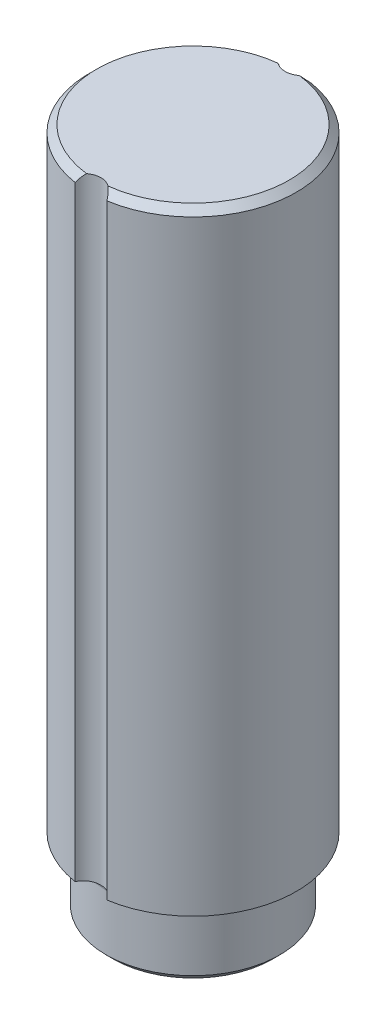
ISO-10303-21;
HEADER;
FILE_DESCRIPTION(('STEP AP214'),'2;1');
FILE_NAME('part.step','',(''),(''),'','','');
FILE_SCHEMA(('AUTOMOTIVE_DESIGN { 1 0 10303 214 1 1 1 1 }'));
ENDSEC;
DATA;
#1=APPLICATION_CONTEXT('core data for automotive mechanical design processes');
#2=APPLICATION_PROTOCOL_DEFINITION('international standard','automotive_design',2000,#1);
#3=PRODUCT_CONTEXT('',#1,'mechanical');
#4=PRODUCT('Part','Part','',(#3));
#5=PRODUCT_RELATED_PRODUCT_CATEGORY('part','',(#4));
#6=PRODUCT_DEFINITION_FORMATION('','',#4);
#7=PRODUCT_DEFINITION_CONTEXT('part definition',#1,'design');
#8=PRODUCT_DEFINITION('design','',#6,#7);
#9=PRODUCT_DEFINITION_SHAPE('','',#8);
#10=(LENGTH_UNIT() NAMED_UNIT(*) SI_UNIT(.MILLI.,.METRE.));
#11=(NAMED_UNIT(*) PLANE_ANGLE_UNIT() SI_UNIT($,.RADIAN.));
#12=(NAMED_UNIT(*) SI_UNIT($,.STERADIAN.) SOLID_ANGLE_UNIT());
#13=UNCERTAINTY_MEASURE_WITH_UNIT(LENGTH_MEASURE(1.E-05),#10,'distance_accuracy_value','');
#14=(GEOMETRIC_REPRESENTATION_CONTEXT(3) GLOBAL_UNCERTAINTY_ASSIGNED_CONTEXT((#13)) GLOBAL_UNIT_ASSIGNED_CONTEXT((#10,
#11,#12)) REPRESENTATION_CONTEXT('',''));
#15=CARTESIAN_POINT('',(0.,0.,0.));
#16=DIRECTION('',(0.,0.,1.));
#17=DIRECTION('',(1.,0.,0.));
#18=AXIS2_PLACEMENT_3D('',#15,#16,#17);
#19=CARTESIAN_POINT('',(8.98525,0.,0.));
#20=DIRECTION('',(0.,-1.,0.));
#21=DIRECTION('',(0.,0.,-1.));
#22=AXIS2_PLACEMENT_3D('',#19,#20,#21);
#23=PLANE('',#22);
#24=CARTESIAN_POINT('',(0.,0.,0.));
#25=DIRECTION('',(0.,1.,0.));
#26=DIRECTION('',(0.,0.,1.));
#27=AXIS2_PLACEMENT_3D('',#24,#25,#26);
#28=CIRCLE('',#27,8.98525);
#29=CARTESIAN_POINT('',(0.,0.,8.98525));
#30=VERTEX_POINT('',#29);
#31=EDGE_CURVE('E261',#30,#30,#28,.T.);
#32=ORIENTED_EDGE('',*,*,#31,.F.);
#33=EDGE_LOOP('',(#32));
#34=FACE_BOUND('',#33,.T.);
#35=ADVANCED_FACE('F17',(#34),#23,.T.);
#36=CARTESIAN_POINT('',(0.,0.793749999999995,0.));
#37=DIRECTION('',(0.,1.,0.));
#38=DIRECTION('',(0.,0.,1.));
#39=AXIS2_PLACEMENT_3D('',#36,#37,#38);
#40=CONICAL_SURFACE('',#39,9.779,0.785398163397448);
#41=CARTESIAN_POINT('',(0.,0.793749999999995,0.));
#42=DIRECTION('',(0.,-1.,0.));
#43=DIRECTION('',(0.,0.,-1.));
#44=AXIS2_PLACEMENT_3D('',#41,#42,#43);
#45=CIRCLE('',#44,9.779);
#46=CARTESIAN_POINT('',(0.,0.793749999999995,-9.779));
#47=VERTEX_POINT('',#46);
#48=EDGE_CURVE('E257',#47,#47,#45,.F.);
#49=ORIENTED_EDGE('',*,*,#48,.F.);
#50=EDGE_LOOP('',(#49));
#51=FACE_BOUND('',#50,.T.);
#52=ORIENTED_EDGE('',*,*,#31,.T.);
#53=EDGE_LOOP('',(#52));
#54=FACE_BOUND('',#53,.T.);
#55=ADVANCED_FACE('F181',(#51,#54),#40,.T.);
#56=CARTESIAN_POINT('',(0.,0.,0.));
#57=DIRECTION('',(0.,-1.,0.));
#58=DIRECTION('',(0.,0.,-1.));
#59=AXIS2_PLACEMENT_3D('',#56,#57,#58);
#60=CYLINDRICAL_SURFACE('',#59,9.779);
#61=CARTESIAN_POINT('',(0.,7.13104999999999,0.));
#62=DIRECTION('',(0.,-1.,0.));
#63=DIRECTION('',(0.,0.,-1.));
#64=AXIS2_PLACEMENT_3D('',#61,#62,#63);
#65=CIRCLE('',#64,9.779);
#66=CARTESIAN_POINT('',(0.,7.13104999999999,-9.779));
#67=VERTEX_POINT('',#66);
#68=EDGE_CURVE('E242',#67,#67,#65,.T.);
#69=ORIENTED_EDGE('',*,*,#68,.T.);
#70=EDGE_LOOP('',(#69));
#71=FACE_BOUND('',#70,.T.);
#72=ORIENTED_EDGE('',*,*,#48,.T.);
#73=EDGE_LOOP('',(#72));
#74=FACE_BOUND('',#73,.T.);
#75=ADVANCED_FACE('F179',(#71,#74),#60,.T.);
#76=CARTESIAN_POINT('',(11.6459,7.9248,0.));
#77=DIRECTION('',(0.,-1.,0.));
#78=DIRECTION('',(0.,0.,-1.));
#79=AXIS2_PLACEMENT_3D('',#76,#77,#78);
#80=PLANE('',#79);
#81=CARTESIAN_POINT('',(0.,7.92479999999999,0.));
#82=DIRECTION('',(0.,-1.,0.));
#83=DIRECTION('',(0.0752699168022908,0.,-0.997163196084059));
#84=AXIS2_PLACEMENT_3D('',#81,#82,#83);
#85=CIRCLE('',#84,10.5727499999999);
#86=CARTESIAN_POINT('',(0.795810012871336,7.9248,10.5427571813977));
#87=VERTEX_POINT('',#86);
#88=CARTESIAN_POINT('',(0.795810012871419,7.9248,-10.5427571813977));
#89=VERTEX_POINT('',#88);
#90=EDGE_CURVE('E164',#87,#89,#85,.F.);
#91=ORIENTED_EDGE('',*,*,#90,.T.);
#92=CARTESIAN_POINT('',(0.,7.9248,-12.3571));
#93=DIRECTION('',(0.,-1.,0.));
#94=DIRECTION('',(0.,0.,-1.));
#95=AXIS2_PLACEMENT_3D('',#92,#93,#94);
#96=CIRCLE('',#95,1.9812);
#97=CARTESIAN_POINT('',(1.78980689472723,7.9248,-11.5075443987667));
#98=VERTEX_POINT('',#97);
#99=EDGE_CURVE('E255',#89,#98,#96,.F.);
#100=ORIENTED_EDGE('',*,*,#99,.T.);
#101=CARTESIAN_POINT('',(0.,7.9248,0.));
#102=DIRECTION('',(0.,-1.,0.));
#103=DIRECTION('',(0.,0.,-1.));
#104=AXIS2_PLACEMENT_3D('',#101,#102,#103);
#105=CIRCLE('',#104,11.6459);
#106=CARTESIAN_POINT('',(1.78980689472723,7.9248,11.5075443987667));
#107=VERTEX_POINT('',#106);
#108=EDGE_CURVE('E230',#107,#98,#105,.F.);
#109=ORIENTED_EDGE('',*,*,#108,.F.);
#110=CARTESIAN_POINT('',(0.,7.9248,12.3571));
#111=DIRECTION('',(0.,-1.,0.));
#112=DIRECTION('',(0.,0.,-1.));
#113=AXIS2_PLACEMENT_3D('',#110,#111,#112);
#114=CIRCLE('',#113,1.9812);
#115=EDGE_CURVE('E233',#107,#87,#114,.F.);
#116=ORIENTED_EDGE('',*,*,#115,.T.);
#117=EDGE_LOOP('',(#91,#100,#109,#116));
#118=FACE_BOUND('',#117,.T.);
#119=ADVANCED_FACE('F170',(#118),#80,.T.);
#120=CARTESIAN_POINT('',(0.,76.19365,0.));
#121=DIRECTION('',(0.,-1.,0.));
#122=DIRECTION('',(0.,0.,-1.));
#123=AXIS2_PLACEMENT_3D('',#120,#121,#122);
#124=CONICAL_SURFACE('',#123,11.6459,0.785398163397453);
#125=CARTESIAN_POINT('',(0.,76.19365,0.));
#126=DIRECTION('',(0.,-1.,0.));
#127=DIRECTION('',(0.,0.,-1.));
#128=AXIS2_PLACEMENT_3D('',#125,#126,#127);
#129=CIRCLE('',#128,11.6459);
#130=CARTESIAN_POINT('',(1.78980689472723,76.19365,-11.5075443987667));
#131=VERTEX_POINT('',#130);
#132=CARTESIAN_POINT('',(1.78980689472723,76.19365,11.5075443987667));
#133=VERTEX_POINT('',#132);
#134=EDGE_CURVE('E113',#131,#133,#129,.T.);
#135=ORIENTED_EDGE('',*,*,#134,.F.);
#136=CARTESIAN_POINT('',(1.78980689472723,76.19365,-11.5075443987667));
#137=CARTESIAN_POINT('',(1.76367275760736,76.2520307195092,-11.4525194049209));
#138=CARTESIAN_POINT('',(1.73484008403179,76.3100072097882,-11.3982976295905));
#139=CARTESIAN_POINT('',(1.67151292796357,76.424823742986,-11.2917054887814));
#140=CARTESIAN_POINT('',(1.63700608253407,76.4816609934172,-11.2393394764033));
#141=CARTESIAN_POINT('',(1.56282773991506,76.5926393763269,-11.1378370761575));
#142=CARTESIAN_POINT('',(1.52325608290578,76.6468101596186,-11.088660451849));
#143=CARTESIAN_POINT('',(1.43827709468032,76.7528560352614,-10.9930625767601));
#144=CARTESIAN_POINT('',(1.39287676929582,76.8047337847255,-10.9466381143474));
#145=CARTESIAN_POINT('',(1.3225942156513,76.8777767119877,-10.8817086654199));
#146=CARTESIAN_POINT('',(1.300155854131,76.9001450644983,-10.8618876081054));
#147=CARTESIAN_POINT('',(1.25391420829405,76.9442741655984,-10.8228999268623));
#148=CARTESIAN_POINT('',(1.23010597360949,76.9660322250162,-10.8037361352797));
#149=CARTESIAN_POINT('',(1.20563816179418,76.9874,-10.7849708504625));
#150=B_SPLINE_CURVE_WITH_KNOTS('',3,(#136,#137,#138,#139,#140,#141,#142,#143,#144,#145,#146,
#147,#148,#149),.UNSPECIFIED.,.F.,.F.,(4,2,2,2,2,2,4),(0.,0.253125031438296,0.506809064921913,
0.756097816528622,1.00508968994883,1.11717648021464,1.22969743910324),.UNSPECIFIED.);
#151=CARTESIAN_POINT('',(1.20563816179418,76.9874,-10.7849708504625));
#152=VERTEX_POINT('',#151);
#153=EDGE_CURVE('E72',#131,#152,#150,.T.);
#154=ORIENTED_EDGE('',*,*,#153,.T.);
#155=CARTESIAN_POINT('',(0.,76.9874,0.));
#156=DIRECTION('',(0.,-1.,0.));
#157=DIRECTION('',(0.,0.,-1.));
#158=AXIS2_PLACEMENT_3D('',#155,#156,#157);
#159=CIRCLE('',#158,10.85215);
#160=CARTESIAN_POINT('',(1.20563816179419,76.9874,10.7849708504625));
#161=VERTEX_POINT('',#160);
#162=EDGE_CURVE('E228',#161,#152,#159,.F.);
#163=ORIENTED_EDGE('',*,*,#162,.F.);
#164=CARTESIAN_POINT('',(1.20563816179418,76.9874,10.7849708504625));
#165=CARTESIAN_POINT('',(1.26105805787665,76.9389582381342,10.8275065899632));
#166=CARTESIAN_POINT('',(1.31310956229784,76.8885756617412,10.8720438773979));
#167=CARTESIAN_POINT('',(1.410740785187,76.7848121947532,10.9644394949207));
#168=CARTESIAN_POINT('',(1.45632766395113,76.7314347143042,11.0122940618509));
#169=CARTESIAN_POINT('',(1.54081682142738,76.6232215363089,11.1100456544193));
#170=CARTESIAN_POINT('',(1.57980432046853,76.5684170283966,11.159904348199));
#171=CARTESIAN_POINT('',(1.6521205649104,76.4571905866062,11.2618569291954));
#172=CARTESIAN_POINT('',(1.68544990189068,76.4007688225393,11.3139505820254));
#173=CARTESIAN_POINT('',(1.7293442505662,76.318991859575,11.390027227462));
#174=CARTESIAN_POINT('',(1.74212825521183,76.2941025144679,11.4132563490039));
#175=CARTESIAN_POINT('',(1.76671465778168,76.2440536654611,11.4601190560142));
#176=CARTESIAN_POINT('',(1.77851384108867,76.2188935579844,11.4837536840092));
#177=CARTESIAN_POINT('',(1.78980689472742,76.19365,11.5075443987666));
#178=B_SPLINE_CURVE_WITH_KNOTS('',3,(#164,#165,#166,#167,#168,#169,#170,#171,#172,#173,#174,
#175,#176,#177),.UNSPECIFIED.,.F.,.F.,(4,2,2,2,2,2,4),(0.,0.254800317001112,0.509316172175835,
0.760241911417499,1.0111413993631,1.12022724144643,1.22965626298281),.UNSPECIFIED.);
#179=EDGE_CURVE('E235',#161,#133,#178,.T.);
#180=ORIENTED_EDGE('',*,*,#179,.T.);
#181=EDGE_LOOP('',(#135,#154,#163,#180));
#182=FACE_BOUND('',#181,.T.);
#183=ADVANCED_FACE('F138',(#182),#124,.T.);
#184=CARTESIAN_POINT('',(0.,7.13104999999999,0.));
#185=DIRECTION('',(0.,-1.,0.));
#186=DIRECTION('',(0.,0.,-1.));
#187=AXIS2_PLACEMENT_3D('',#184,#185,#186);
#188=TOROIDAL_SURFACE('',#187,10.57275,0.79375);
#189=ORIENTED_EDGE('',*,*,#68,.F.);
#190=EDGE_LOOP('',(#189));
#191=FACE_BOUND('',#190,.T.);
#192=CARTESIAN_POINT('',(0.795810012871411,7.92479999999999,-10.5427571813977));
#193=CARTESIAN_POINT('',(0.746108588050314,7.92476512440768,-10.5209524923751));
#194=CARTESIAN_POINT('',(0.695537062521087,7.92357202151697,-10.501210294997));
#195=CARTESIAN_POINT('',(0.592956586339098,7.91994863489386,-10.4659378141239));
#196=CARTESIAN_POINT('',(0.540946939313092,7.91751774150879,-10.4504096119436));
#197=CARTESIAN_POINT('',(0.436203677513011,7.91251744760414,-10.4237655778831));
#198=CARTESIAN_POINT('',(0.383477490938247,7.90994911334089,-10.4126201663493));
#199=CARTESIAN_POINT('',(0.277292752962058,7.90545418302785,-10.3946633450494));
#200=CARTESIAN_POINT('',(0.223834742024051,7.90352713745892,-10.3878488963807));
#201=CARTESIAN_POINT('',(0.141906313459836,7.90147366755469,-10.3807846613819));
#202=CARTESIAN_POINT('',(0.113574489676365,7.90092668328819,-10.378954390617));
#203=CARTESIAN_POINT('',(0.0568296465839637,7.90019078634216,-10.3765114441518));
#204=CARTESIAN_POINT('',(0.0284165787578091,7.90000217810124,-10.3758998036503));
#205=CARTESIAN_POINT('',(-0.0542792274124052,7.90000537185428,-10.3759003750525));
#206=CARTESIAN_POINT('',(-0.108571264735782,7.90069962436135,-10.3781330850985));
#207=CARTESIAN_POINT('',(-0.216789197771222,7.90329713537928,-10.3870475008371));
#208=CARTESIAN_POINT('',(-0.270714806919555,7.90520124984784,-10.3937323565119));
#209=CARTESIAN_POINT('',(-0.377839707216739,7.90968745721573,-10.4115047626235));
#210=CARTESIAN_POINT('',(-0.431038503952448,7.91226998959184,-10.4225951693551));
#211=CARTESIAN_POINT('',(-0.536322963696669,7.9172979838893,-10.4491023188173));
#212=CARTESIAN_POINT('',(-0.588409364043924,7.919743538467,-10.4645160936204));
#213=CARTESIAN_POINT('',(-0.666222172469301,7.92255597046561,-10.4910662002341));
#214=CARTESIAN_POINT('',(-0.692471349882677,7.92335563135521,-10.5006470574982));
#215=CARTESIAN_POINT('',(-0.744493374878836,7.92447620650322,-10.520891823043));
#216=CARTESIAN_POINT('',(-0.770267127165724,7.92479814889768,-10.5315533524985));
#217=CARTESIAN_POINT('',(-0.795810012871312,7.92479999999999,-10.5427571813977));
#218=B_SPLINE_CURVE_WITH_KNOTS('',3,(#192,#193,#194,#195,#196,#197,#198,#199,#200,#201,#202,
#203,#204,#205,#206,#207,#208,#209,#210,#211,#212,#213,#214,#215,#216,#217),.UNSPECIFIED.,.F.,
.F.,(4,2,2,2,2,2,2,2,2,2,2,2,4),(0.,0.162723488244861,0.325527200813184,0.487212469216876,
0.648784162455957,0.733947490100946,0.819183131271871,0.981993890096504,1.14491996334031,
1.30795184092032,1.47087207232752,1.55470995156764,1.63836713359519),.UNSPECIFIED.);
#219=CARTESIAN_POINT('',(-0.795810012871334,7.9248,-10.5427571813977));
#220=VERTEX_POINT('',#219);
#221=EDGE_CURVE('E97',#89,#220,#218,.T.);
#222=ORIENTED_EDGE('',*,*,#221,.F.);
#223=ORIENTED_EDGE('',*,*,#90,.F.);
#224=CARTESIAN_POINT('',(-0.795810012871406,7.92479999999999,10.5427571813977));
#225=CARTESIAN_POINT('',(-0.746108588050307,7.92476512440768,10.5209524923751));
#226=CARTESIAN_POINT('',(-0.69553706252108,7.92357202151698,10.501210294997));
#227=CARTESIAN_POINT('',(-0.592956586339092,7.91994863489386,10.4659378141239));
#228=CARTESIAN_POINT('',(-0.540946939313088,7.91751774150879,10.4504096119436));
#229=CARTESIAN_POINT('',(-0.436203677513008,7.91251744760414,10.4237655778831));
#230=CARTESIAN_POINT('',(-0.383477490938244,7.90994911334089,10.4126201663493));
#231=CARTESIAN_POINT('',(-0.277292752962052,7.90545418302785,10.3946633450494));
#232=CARTESIAN_POINT('',(-0.223834742024043,7.90352713745892,10.3878488963807));
#233=CARTESIAN_POINT('',(-0.141906313459828,7.90147366755469,10.3807846613819));
#234=CARTESIAN_POINT('',(-0.113574489676358,7.90092668328819,10.378954390617));
#235=CARTESIAN_POINT('',(-0.0568296465839601,7.90019078634216,10.3765114441518));
#236=CARTESIAN_POINT('',(-0.0284165787578065,7.90000217810124,10.3758998036503));
#237=CARTESIAN_POINT('',(0.0542792274124077,7.90000537185428,10.3759003750525));
#238=CARTESIAN_POINT('',(0.108571264735785,7.90069962436135,10.3781330850985));
#239=CARTESIAN_POINT('',(0.216789197771227,7.90329713537928,10.3870475008371));
#240=CARTESIAN_POINT('',(0.270714806919561,7.90520124984784,10.3937323565119));
#241=CARTESIAN_POINT('',(0.377839707216747,7.90968745721573,10.4115047626235));
#242=CARTESIAN_POINT('',(0.431038503952457,7.91226998959184,10.4225951693551));
#243=CARTESIAN_POINT('',(0.53632296369668,7.9172979838893,10.4491023188173));
#244=CARTESIAN_POINT('',(0.588409364043936,7.919743538467,10.4645160936204));
#245=CARTESIAN_POINT('',(0.666222172469313,7.92255597046561,10.4910662002341));
#246=CARTESIAN_POINT('',(0.692471349882688,7.92335563135521,10.5006470574982));
#247=CARTESIAN_POINT('',(0.744493374878843,7.92447620650322,10.520891823043));
#248=CARTESIAN_POINT('',(0.770267127165729,7.92479814889768,10.5315533524986));
#249=CARTESIAN_POINT('',(0.795810012871316,7.92479999999999,10.5427571813977));
#250=B_SPLINE_CURVE_WITH_KNOTS('',3,(#224,#225,#226,#227,#228,#229,#230,#231,#232,#233,#234,
#235,#236,#237,#238,#239,#240,#241,#242,#243,#244,#245,#246,#247,#248,#249),.UNSPECIFIED.,.F.,
.F.,(4,2,2,2,2,2,2,2,2,2,2,2,4),(0.,0.162723488244861,0.32552720081318,0.487212469216874,
0.648784162455959,0.733947490100944,0.819183131271866,0.981993890096501,1.14491996334031,
1.30795184092033,1.47087207232752,1.55470995156765,1.63836713359519),.UNSPECIFIED.);
#251=CARTESIAN_POINT('',(-0.795810012871415,7.9248,10.5427571813977));
#252=VERTEX_POINT('',#251);
#253=EDGE_CURVE('E243',#252,#87,#250,.T.);
#254=ORIENTED_EDGE('',*,*,#253,.F.);
#255=CARTESIAN_POINT('',(0.,7.92479999999999,0.));
#256=DIRECTION('',(0.,-1.,0.));
#257=DIRECTION('',(-0.0752699168022899,0.,0.997163196084059));
#258=AXIS2_PLACEMENT_3D('',#255,#256,#257);
#259=CIRCLE('',#258,10.5727499999999);
#260=EDGE_CURVE('E108',#220,#252,#259,.F.);
#261=ORIENTED_EDGE('',*,*,#260,.F.);
#262=EDGE_LOOP('',(#222,#223,#254,#261));
#263=FACE_BOUND('',#262,.T.);
#264=ADVANCED_FACE('F133',(#191,#263),#188,.F.);
#265=CARTESIAN_POINT('',(0.,0.,0.));
#266=DIRECTION('',(0.,-1.,0.));
#267=DIRECTION('',(0.,0.,-1.));
#268=AXIS2_PLACEMENT_3D('',#265,#266,#267);
#269=CYLINDRICAL_SURFACE('',#268,11.6459);
#270=ORIENTED_EDGE('',*,*,#108,.T.);
#271=DIRECTION('',(0.,-1.,0.));
#272=VECTOR('',#271,1.);
#273=CARTESIAN_POINT('',(1.78980689472723,76.9874,-11.5075443987667));
#274=LINE('',#273,#272);
#275=EDGE_CURVE('E99',#98,#131,#274,.F.);
#276=ORIENTED_EDGE('',*,*,#275,.T.);
#277=ORIENTED_EDGE('',*,*,#134,.T.);
#278=DIRECTION('',(0.,-1.,0.));
#279=VECTOR('',#278,1.);
#280=CARTESIAN_POINT('',(1.78980689472723,0.,11.5075443987667));
#281=LINE('',#280,#279);
#282=EDGE_CURVE('E168',#133,#107,#281,.T.);
#283=ORIENTED_EDGE('',*,*,#282,.T.);
#284=EDGE_LOOP('',(#270,#276,#277,#283));
#285=FACE_BOUND('',#284,.T.);
#286=ADVANCED_FACE('F130',(#285),#269,.T.);
#287=CARTESIAN_POINT('',(0.,76.9874,0.));
#288=DIRECTION('',(0.,1.,0.));
#289=DIRECTION('',(0.,0.,1.));
#290=AXIS2_PLACEMENT_3D('',#287,#288,#289);
#291=PLANE('',#290);
#292=ORIENTED_EDGE('',*,*,#162,.T.);
#293=CARTESIAN_POINT('',(0.,76.9874,-12.3571));
#294=DIRECTION('',(0.,-1.,0.));
#295=DIRECTION('',(0.,0.,-1.));
#296=AXIS2_PLACEMENT_3D('',#293,#294,#295);
#297=CIRCLE('',#296,1.9812);
#298=CARTESIAN_POINT('',(-1.20563816179417,76.9874,-10.7849708504625));
#299=VERTEX_POINT('',#298);
#300=EDGE_CURVE('E89',#152,#299,#297,.T.);
#301=ORIENTED_EDGE('',*,*,#300,.T.);
#302=CARTESIAN_POINT('',(0.,76.9874,0.));
#303=DIRECTION('',(0.,-1.,0.));
#304=DIRECTION('',(0.,0.,-1.));
#305=AXIS2_PLACEMENT_3D('',#302,#303,#304);
#306=CIRCLE('',#305,10.85215);
#307=CARTESIAN_POINT('',(-1.20563816179418,76.9874,10.7849708504625));
#308=VERTEX_POINT('',#307);
#309=EDGE_CURVE('E215',#308,#299,#306,.T.);
#310=ORIENTED_EDGE('',*,*,#309,.F.);
#311=CARTESIAN_POINT('',(0.,76.9874,12.3571));
#312=DIRECTION('',(0.,-1.,0.));
#313=DIRECTION('',(0.,0.,-1.));
#314=AXIS2_PLACEMENT_3D('',#311,#312,#313);
#315=CIRCLE('',#314,1.9812);
#316=EDGE_CURVE('E223',#308,#161,#315,.T.);
#317=ORIENTED_EDGE('',*,*,#316,.T.);
#318=EDGE_LOOP('',(#292,#301,#310,#317));
#319=FACE_BOUND('',#318,.T.);
#320=ADVANCED_FACE('F125',(#319),#291,.T.);
#321=CARTESIAN_POINT('',(11.6459,7.9248,0.));
#322=DIRECTION('',(0.,-1.,0.));
#323=DIRECTION('',(0.,0.,-1.));
#324=AXIS2_PLACEMENT_3D('',#321,#322,#323);
#325=PLANE('',#324);
#326=CARTESIAN_POINT('',(0.,7.9248,0.));
#327=DIRECTION('',(0.,-1.,0.));
#328=DIRECTION('',(0.,0.,-1.));
#329=AXIS2_PLACEMENT_3D('',#326,#327,#328);
#330=CIRCLE('',#329,11.6459);
#331=CARTESIAN_POINT('',(-1.78980689472723,7.9248,-11.5075443987667));
#332=VERTEX_POINT('',#331);
#333=CARTESIAN_POINT('',(-1.78980689472723,7.9248,11.5075443987667));
#334=VERTEX_POINT('',#333);
#335=EDGE_CURVE('E78',#332,#334,#330,.F.);
#336=ORIENTED_EDGE('',*,*,#335,.F.);
#337=CARTESIAN_POINT('',(0.,7.9248,-12.3571));
#338=DIRECTION('',(0.,-1.,0.));
#339=DIRECTION('',(0.,0.,-1.));
#340=AXIS2_PLACEMENT_3D('',#337,#338,#339);
#341=CIRCLE('',#340,1.9812);
#342=EDGE_CURVE('E82',#332,#220,#341,.F.);
#343=ORIENTED_EDGE('',*,*,#342,.T.);
#344=ORIENTED_EDGE('',*,*,#260,.T.);
#345=CARTESIAN_POINT('',(0.,7.9248,12.3571));
#346=DIRECTION('',(0.,-1.,0.));
#347=DIRECTION('',(0.,0.,-1.));
#348=AXIS2_PLACEMENT_3D('',#345,#346,#347);
#349=CIRCLE('',#348,1.9812);
#350=EDGE_CURVE('E84',#252,#334,#349,.F.);
#351=ORIENTED_EDGE('',*,*,#350,.T.);
#352=EDGE_LOOP('',(#336,#343,#344,#351));
#353=FACE_BOUND('',#352,.T.);
#354=ADVANCED_FACE('F80',(#353),#325,.T.);
#355=CARTESIAN_POINT('',(0.,76.9874,12.3571));
#356=DIRECTION('',(0.,-1.,0.));
#357=DIRECTION('',(0.,0.,-1.));
#358=AXIS2_PLACEMENT_3D('',#355,#356,#357);
#359=CYLINDRICAL_SURFACE('',#358,1.9812);
#360=ORIENTED_EDGE('',*,*,#316,.F.);
#361=CARTESIAN_POINT('',(-1.78980689472723,76.19365,11.5075443987667));
#362=CARTESIAN_POINT('',(-1.76367275760735,76.2520307195092,11.4525194049209));
#363=CARTESIAN_POINT('',(-1.73484008403178,76.3100072097882,11.3982976295905));
#364=CARTESIAN_POINT('',(-1.67151292796357,76.424823742986,11.2917054887814));
#365=CARTESIAN_POINT('',(-1.63700608253406,76.4816609934172,11.2393394764033));
#366=CARTESIAN_POINT('',(-1.56282773991505,76.5926393763269,11.1378370761575));
#367=CARTESIAN_POINT('',(-1.52325608290578,76.6468101596186,11.088660451849));
#368=CARTESIAN_POINT('',(-1.43827709468032,76.7528560352614,10.9930625767601));
#369=CARTESIAN_POINT('',(-1.39287676929582,76.8047337847255,10.9466381143474));
#370=CARTESIAN_POINT('',(-1.32259421565129,76.8777767119877,10.8817086654199));
#371=CARTESIAN_POINT('',(-1.300155854131,76.9001450644983,10.8618876081054));
#372=CARTESIAN_POINT('',(-1.25391420829404,76.9442741655984,10.8228999268623));
#373=CARTESIAN_POINT('',(-1.23010597360948,76.9660322250162,10.8037361352797));
#374=CARTESIAN_POINT('',(-1.20563816179417,76.9874,10.7849708504625));
#375=B_SPLINE_CURVE_WITH_KNOTS('',3,(#361,#362,#363,#364,#365,#366,#367,#368,#369,#370,#371,
#372,#373,#374),.UNSPECIFIED.,.F.,.F.,(4,2,2,2,2,2,4),(0.,0.253125031438296,0.506809064921913,
0.756097816528621,1.00508968994883,1.11717648021464,1.22969743910324),.UNSPECIFIED.);
#376=CARTESIAN_POINT('',(-1.78980689472723,76.19365,11.5075443987667));
#377=VERTEX_POINT('',#376);
#378=EDGE_CURVE('E218',#377,#308,#375,.T.);
#379=ORIENTED_EDGE('',*,*,#378,.F.);
#380=DIRECTION('',(0.,-1.,0.));
#381=VECTOR('',#380,1.);
#382=CARTESIAN_POINT('',(-1.78980689472723,0.,11.5075443987667));
#383=LINE('',#382,#381);
#384=EDGE_CURVE('E88',#334,#377,#383,.F.);
#385=ORIENTED_EDGE('',*,*,#384,.F.);
#386=ORIENTED_EDGE('',*,*,#350,.F.);
#387=ORIENTED_EDGE('',*,*,#253,.T.);
#388=ORIENTED_EDGE('',*,*,#115,.F.);
#389=ORIENTED_EDGE('',*,*,#282,.F.);
#390=ORIENTED_EDGE('',*,*,#179,.F.);
#391=EDGE_LOOP('',(#360,#379,#385,#386,#387,#388,#389,#390));
#392=FACE_BOUND('',#391,.T.);
#393=ADVANCED_FACE('F124',(#392),#359,.F.);
#394=CARTESIAN_POINT('',(0.,76.19365,0.));
#395=DIRECTION('',(0.,-1.,0.));
#396=DIRECTION('',(0.,0.,-1.));
#397=AXIS2_PLACEMENT_3D('',#394,#395,#396);
#398=CONICAL_SURFACE('',#397,11.6459,0.785398163397453);
#399=ORIENTED_EDGE('',*,*,#309,.T.);
#400=CARTESIAN_POINT('',(-1.20563816179418,76.9874,-10.7849708504625));
#401=CARTESIAN_POINT('',(-1.26105805787664,76.9389582381342,-10.8275065899632));
#402=CARTESIAN_POINT('',(-1.31310956229783,76.8885756617412,-10.8720438773979));
#403=CARTESIAN_POINT('',(-1.410740785187,76.7848121947532,-10.9644394949207));
#404=CARTESIAN_POINT('',(-1.45632766395112,76.7314347143042,-11.0122940618509));
#405=CARTESIAN_POINT('',(-1.54081682142737,76.6232215363089,-11.1100456544193));
#406=CARTESIAN_POINT('',(-1.57980432046853,76.5684170283966,-11.159904348199));
#407=CARTESIAN_POINT('',(-1.65212056491039,76.4571905866062,-11.2618569291954));
#408=CARTESIAN_POINT('',(-1.68544990189068,76.4007688225393,-11.3139505820254));
#409=CARTESIAN_POINT('',(-1.72934425056619,76.318991859575,-11.390027227462));
#410=CARTESIAN_POINT('',(-1.74212825521183,76.2941025144679,-11.4132563490039));
#411=CARTESIAN_POINT('',(-1.76671465778168,76.2440536654611,-11.4601190560142));
#412=CARTESIAN_POINT('',(-1.77851384108867,76.2188935579844,-11.4837536840092));
#413=CARTESIAN_POINT('',(-1.78980689472741,76.19365,-11.5075443987666));
#414=B_SPLINE_CURVE_WITH_KNOTS('',3,(#400,#401,#402,#403,#404,#405,#406,#407,#408,#409,#410,
#411,#412,#413),.UNSPECIFIED.,.F.,.F.,(4,2,2,2,2,2,4),(0.,0.254800317001112,0.509316172175836,
0.7602419114175,1.0111413993631,1.12022724144643,1.22965626298281),.UNSPECIFIED.);
#415=CARTESIAN_POINT('',(-1.78980689472723,76.19365,-11.5075443987667));
#416=VERTEX_POINT('',#415);
#417=EDGE_CURVE('E37',#299,#416,#414,.T.);
#418=ORIENTED_EDGE('',*,*,#417,.T.);
#419=CARTESIAN_POINT('',(0.,76.19365,0.));
#420=DIRECTION('',(0.,-1.,0.));
#421=DIRECTION('',(0.,0.,-1.));
#422=AXIS2_PLACEMENT_3D('',#419,#420,#421);
#423=CIRCLE('',#422,11.6459);
#424=EDGE_CURVE('E28',#377,#416,#423,.T.);
#425=ORIENTED_EDGE('',*,*,#424,.F.);
#426=ORIENTED_EDGE('',*,*,#378,.T.);
#427=EDGE_LOOP('',(#399,#418,#425,#426));
#428=FACE_BOUND('',#427,.T.);
#429=ADVANCED_FACE('F197',(#428),#398,.T.);
#430=CARTESIAN_POINT('',(0.,76.9874,-12.3571));
#431=DIRECTION('',(0.,-1.,0.));
#432=DIRECTION('',(0.,0.,-1.));
#433=AXIS2_PLACEMENT_3D('',#430,#431,#432);
#434=CYLINDRICAL_SURFACE('',#433,1.9812);
#435=ORIENTED_EDGE('',*,*,#153,.F.);
#436=ORIENTED_EDGE('',*,*,#275,.F.);
#437=ORIENTED_EDGE('',*,*,#99,.F.);
#438=ORIENTED_EDGE('',*,*,#221,.T.);
#439=ORIENTED_EDGE('',*,*,#342,.F.);
#440=DIRECTION('',(0.,-1.,0.));
#441=VECTOR('',#440,1.);
#442=CARTESIAN_POINT('',(-1.78980689472724,0.,-11.5075443987667));
#443=LINE('',#442,#441);
#444=EDGE_CURVE('E11',#416,#332,#443,.T.);
#445=ORIENTED_EDGE('',*,*,#444,.F.);
#446=ORIENTED_EDGE('',*,*,#417,.F.);
#447=ORIENTED_EDGE('',*,*,#300,.F.);
#448=EDGE_LOOP('',(#435,#436,#437,#438,#439,#445,#446,#447));
#449=FACE_BOUND('',#448,.T.);
#450=ADVANCED_FACE('F93',(#449),#434,.F.);
#451=CARTESIAN_POINT('',(0.,0.,0.));
#452=DIRECTION('',(0.,-1.,0.));
#453=DIRECTION('',(0.,0.,-1.));
#454=AXIS2_PLACEMENT_3D('',#451,#452,#453);
#455=CYLINDRICAL_SURFACE('',#454,11.6459);
#456=ORIENTED_EDGE('',*,*,#424,.T.);
#457=ORIENTED_EDGE('',*,*,#444,.T.);
#458=ORIENTED_EDGE('',*,*,#335,.T.);
#459=ORIENTED_EDGE('',*,*,#384,.T.);
#460=EDGE_LOOP('',(#456,#457,#458,#459));
#461=FACE_BOUND('',#460,.T.);
#462=ADVANCED_FACE('F101',(#461),#455,.T.);
#463=CLOSED_SHELL('',(#35,#55,#75,#119,#183,#264,#286,#320,#354,#393,#429,#450,#462));
#464=MANIFOLD_SOLID_BREP('B1',#463);
#465=ADVANCED_BREP_SHAPE_REPRESENTATION('',(#18,#464),#14);
#466=SHAPE_DEFINITION_REPRESENTATION(#9,#465);
ENDSEC;
END-ISO-10303-21;
